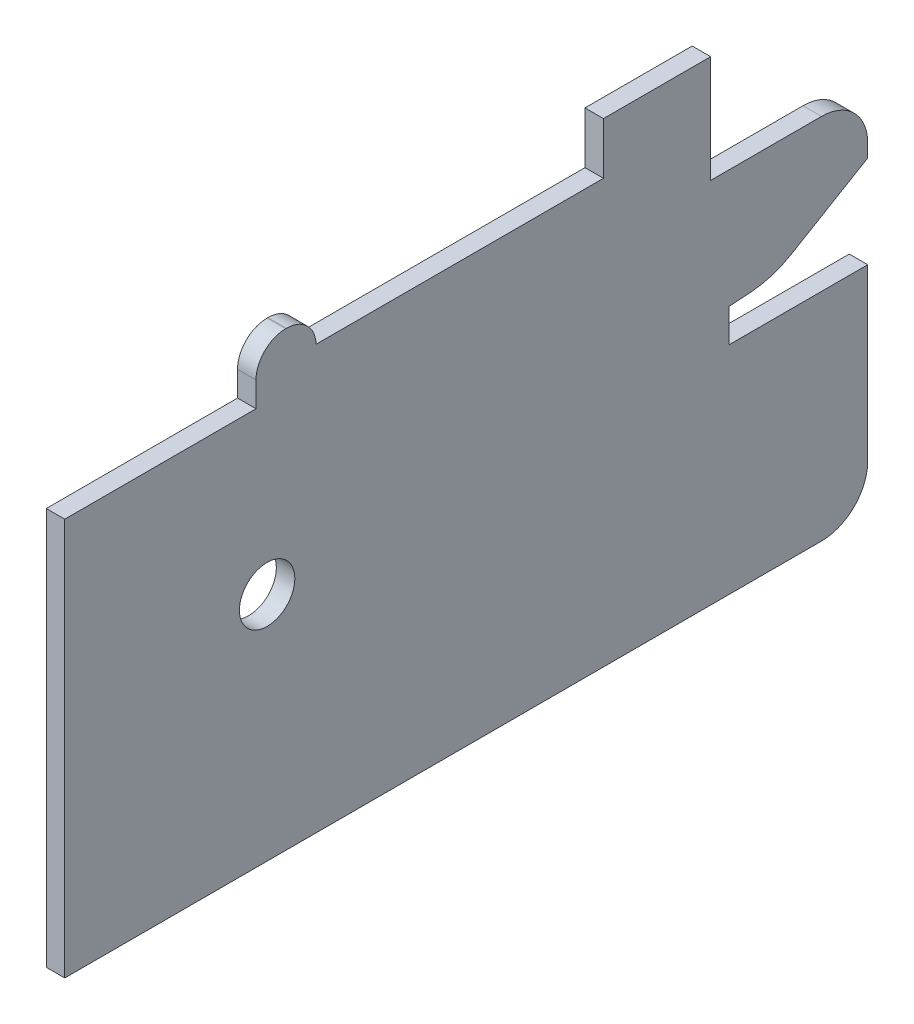
ISO-10303-21;
HEADER;
FILE_DESCRIPTION(('STEP AP214'),'2;1');
FILE_NAME('part.step','',(''),(''),'','','');
FILE_SCHEMA(('AUTOMOTIVE_DESIGN { 1 0 10303 214 1 1 1 1 }'));
ENDSEC;
DATA;
#1=APPLICATION_CONTEXT('core data for automotive mechanical design processes');
#2=APPLICATION_PROTOCOL_DEFINITION('international standard','automotive_design',2000,#1);
#3=PRODUCT_CONTEXT('',#1,'mechanical');
#4=PRODUCT('Part','Part','',(#3));
#5=PRODUCT_RELATED_PRODUCT_CATEGORY('part','',(#4));
#6=PRODUCT_DEFINITION_FORMATION('','',#4);
#7=PRODUCT_DEFINITION_CONTEXT('part definition',#1,'design');
#8=PRODUCT_DEFINITION('design','',#6,#7);
#9=PRODUCT_DEFINITION_SHAPE('','',#8);
#10=(LENGTH_UNIT() NAMED_UNIT(*) SI_UNIT(.MILLI.,.METRE.));
#11=(NAMED_UNIT(*) PLANE_ANGLE_UNIT() SI_UNIT($,.RADIAN.));
#12=(NAMED_UNIT(*) SI_UNIT($,.STERADIAN.) SOLID_ANGLE_UNIT());
#13=UNCERTAINTY_MEASURE_WITH_UNIT(LENGTH_MEASURE(1.E-05),#10,'distance_accuracy_value','');
#14=(GEOMETRIC_REPRESENTATION_CONTEXT(3) GLOBAL_UNCERTAINTY_ASSIGNED_CONTEXT((#13)) GLOBAL_UNIT_ASSIGNED_CONTEXT((#10,
#11,#12)) REPRESENTATION_CONTEXT('',''));
#15=CARTESIAN_POINT('',(0.,0.,0.));
#16=DIRECTION('',(0.,0.,1.));
#17=DIRECTION('',(1.,0.,0.));
#18=AXIS2_PLACEMENT_3D('',#15,#16,#17);
#19=CARTESIAN_POINT('',(-2.,23.4,0.));
#20=DIRECTION('',(0.,0.,-1.));
#21=DIRECTION('',(0.,1.,0.));
#22=AXIS2_PLACEMENT_3D('',#19,#20,#21);
#23=PLANE('',#22);
#24=DIRECTION('',(0.,1.,0.));
#25=VECTOR('',#24,1.);
#26=CARTESIAN_POINT('',(0.,23.4,0.));
#27=LINE('',#26,#25);
#28=CARTESIAN_POINT('',(0.,5.,0.));
#29=VERTEX_POINT('',#28);
#30=CARTESIAN_POINT('',(0.,23.4,0.));
#31=VERTEX_POINT('',#30);
#32=EDGE_CURVE('E240',#29,#31,#27,.T.);
#33=ORIENTED_EDGE('',*,*,#32,.F.);
#34=DIRECTION('',(1.,0.,0.));
#35=VECTOR('',#34,1.);
#36=CARTESIAN_POINT('',(-2.,5.,0.));
#37=LINE('',#36,#35);
#38=CARTESIAN_POINT('',(-2.,5.,0.));
#39=VERTEX_POINT('',#38);
#40=EDGE_CURVE('E181',#29,#39,#37,.F.);
#41=ORIENTED_EDGE('',*,*,#40,.T.);
#42=DIRECTION('',(0.,1.,0.));
#43=VECTOR('',#42,1.);
#44=CARTESIAN_POINT('',(-2.,23.4,0.));
#45=LINE('',#44,#43);
#46=CARTESIAN_POINT('',(-2.,23.4,0.));
#47=VERTEX_POINT('',#46);
#48=EDGE_CURVE('E175',#39,#47,#45,.T.);
#49=ORIENTED_EDGE('',*,*,#48,.T.);
#50=DIRECTION('',(1.,0.,0.));
#51=VECTOR('',#50,1.);
#52=CARTESIAN_POINT('',(-2.,23.4,0.));
#53=LINE('',#52,#51);
#54=EDGE_CURVE('E178',#47,#31,#53,.T.);
#55=ORIENTED_EDGE('',*,*,#54,.T.);
#56=EDGE_LOOP('',(#33,#41,#49,#55));
#57=FACE_BOUND('',#56,.T.);
#58=ADVANCED_FACE('F33',(#57),#23,.T.);
#59=CARTESIAN_POINT('',(-2.,0.,0.));
#60=DIRECTION('',(0.,-1.,0.));
#61=DIRECTION('',(0.,0.,-1.));
#62=AXIS2_PLACEMENT_3D('',#59,#60,#61);
#63=PLANE('',#62);
#64=DIRECTION('',(0.,0.,-1.));
#65=VECTOR('',#64,1.);
#66=CARTESIAN_POINT('',(-2.,0.,0.));
#67=LINE('',#66,#65);
#68=CARTESIAN_POINT('',(-2.,0.,86.9));
#69=VERTEX_POINT('',#68);
#70=CARTESIAN_POINT('',(-2.,0.,5.));
#71=VERTEX_POINT('',#70);
#72=EDGE_CURVE('E194',#69,#71,#67,.T.);
#73=ORIENTED_EDGE('',*,*,#72,.T.);
#74=DIRECTION('',(1.,0.,0.));
#75=VECTOR('',#74,1.);
#76=CARTESIAN_POINT('',(-2.,0.,5.));
#77=LINE('',#76,#75);
#78=CARTESIAN_POINT('',(0.,0.,5.));
#79=VERTEX_POINT('',#78);
#80=EDGE_CURVE('E283',#71,#79,#77,.T.);
#81=ORIENTED_EDGE('',*,*,#80,.T.);
#82=DIRECTION('',(0.,0.,-1.));
#83=VECTOR('',#82,1.);
#84=CARTESIAN_POINT('',(0.,0.,0.));
#85=LINE('',#84,#83);
#86=CARTESIAN_POINT('',(0.,0.,86.9));
#87=VERTEX_POINT('',#86);
#88=EDGE_CURVE('E186',#87,#79,#85,.T.);
#89=ORIENTED_EDGE('',*,*,#88,.F.);
#90=DIRECTION('',(1.,0.,0.));
#91=VECTOR('',#90,1.);
#92=CARTESIAN_POINT('',(-2.,0.,86.9));
#93=LINE('',#92,#91);
#94=EDGE_CURVE('E281',#69,#87,#93,.T.);
#95=ORIENTED_EDGE('',*,*,#94,.F.);
#96=EDGE_LOOP('',(#73,#81,#89,#95));
#97=FACE_BOUND('',#96,.T.);
#98=ADVANCED_FACE('F369',(#97),#63,.T.);
#99=CARTESIAN_POINT('',(-2.,0.,86.9));
#100=DIRECTION('',(0.,0.,1.));
#101=DIRECTION('',(1.,0.,0.));
#102=AXIS2_PLACEMENT_3D('',#99,#100,#101);
#103=PLANE('',#102);
#104=DIRECTION('',(0.,-1.,0.));
#105=VECTOR('',#104,1.);
#106=CARTESIAN_POINT('',(0.,0.,86.9));
#107=LINE('',#106,#105);
#108=CARTESIAN_POINT('',(0.,43.,86.9));
#109=VERTEX_POINT('',#108);
#110=EDGE_CURVE('E276',#109,#87,#107,.T.);
#111=ORIENTED_EDGE('',*,*,#110,.F.);
#112=DIRECTION('',(1.,0.,0.));
#113=VECTOR('',#112,1.);
#114=CARTESIAN_POINT('',(-2.,43.,86.9));
#115=LINE('',#114,#113);
#116=CARTESIAN_POINT('',(-2.,43.,86.9));
#117=VERTEX_POINT('',#116);
#118=EDGE_CURVE('E284',#117,#109,#115,.T.);
#119=ORIENTED_EDGE('',*,*,#118,.F.);
#120=DIRECTION('',(0.,-1.,0.));
#121=VECTOR('',#120,1.);
#122=CARTESIAN_POINT('',(-2.,0.,86.9));
#123=LINE('',#122,#121);
#124=EDGE_CURVE('E235',#117,#69,#123,.T.);
#125=ORIENTED_EDGE('',*,*,#124,.T.);
#126=ORIENTED_EDGE('',*,*,#94,.T.);
#127=EDGE_LOOP('',(#111,#119,#125,#126));
#128=FACE_BOUND('',#127,.T.);
#129=ADVANCED_FACE('F428',(#128),#103,.T.);
#130=CARTESIAN_POINT('',(-2.,43.,86.9));
#131=DIRECTION('',(0.,1.,0.));
#132=DIRECTION('',(0.,0.,1.));
#133=AXIS2_PLACEMENT_3D('',#130,#131,#132);
#134=PLANE('',#133);
#135=DIRECTION('',(0.,0.,1.));
#136=VECTOR('',#135,1.);
#137=CARTESIAN_POINT('',(0.,43.,86.9));
#138=LINE('',#137,#136);
#139=CARTESIAN_POINT('',(0.,43.,66.2));
#140=VERTEX_POINT('',#139);
#141=EDGE_CURVE('E273',#140,#109,#138,.T.);
#142=ORIENTED_EDGE('',*,*,#141,.F.);
#143=DIRECTION('',(1.,0.,0.));
#144=VECTOR('',#143,1.);
#145=CARTESIAN_POINT('',(-2.,43.,66.2));
#146=LINE('',#145,#144);
#147=CARTESIAN_POINT('',(-2.,43.,66.2));
#148=VERTEX_POINT('',#147);
#149=EDGE_CURVE('E286',#148,#140,#146,.T.);
#150=ORIENTED_EDGE('',*,*,#149,.F.);
#151=DIRECTION('',(0.,0.,1.));
#152=VECTOR('',#151,1.);
#153=CARTESIAN_POINT('',(-2.,43.,86.9));
#154=LINE('',#153,#152);
#155=EDGE_CURVE('E232',#148,#117,#154,.T.);
#156=ORIENTED_EDGE('',*,*,#155,.T.);
#157=ORIENTED_EDGE('',*,*,#118,.T.);
#158=EDGE_LOOP('',(#142,#150,#156,#157));
#159=FACE_BOUND('',#158,.T.);
#160=ADVANCED_FACE('F364',(#159),#134,.T.);
#161=CARTESIAN_POINT('',(-2.,43.,66.2));
#162=DIRECTION('',(0.,0.,1.));
#163=DIRECTION('',(1.,0.,0.));
#164=AXIS2_PLACEMENT_3D('',#161,#162,#163);
#165=PLANE('',#164);
#166=DIRECTION('',(0.,-1.,0.));
#167=VECTOR('',#166,1.);
#168=CARTESIAN_POINT('',(0.,43.,66.2));
#169=LINE('',#168,#167);
#170=CARTESIAN_POINT('',(0.,45.6960877582272,66.2));
#171=VERTEX_POINT('',#170);
#172=EDGE_CURVE('E271',#171,#140,#169,.T.);
#173=ORIENTED_EDGE('',*,*,#172,.F.);
#174=DIRECTION('',(1.,0.,0.));
#175=VECTOR('',#174,1.);
#176=CARTESIAN_POINT('',(-2.,45.6960877582272,66.2));
#177=LINE('',#176,#175);
#178=CARTESIAN_POINT('',(-2.,45.6960877582272,66.2));
#179=VERTEX_POINT('',#178);
#180=EDGE_CURVE('E48',#171,#179,#177,.F.);
#181=ORIENTED_EDGE('',*,*,#180,.T.);
#182=DIRECTION('',(0.,-1.,0.));
#183=VECTOR('',#182,1.);
#184=CARTESIAN_POINT('',(-2.,43.,66.2));
#185=LINE('',#184,#183);
#186=EDGE_CURVE('E230',#179,#148,#185,.T.);
#187=ORIENTED_EDGE('',*,*,#186,.T.);
#188=ORIENTED_EDGE('',*,*,#149,.T.);
#189=EDGE_LOOP('',(#173,#181,#187,#188));
#190=FACE_BOUND('',#189,.T.);
#191=ADVANCED_FACE('F361',(#190),#165,.T.);
#192=CARTESIAN_POINT('',(-2.,48.8960877582272,66.2));
#193=DIRECTION('',(0.,1.,0.));
#194=DIRECTION('',(0.,0.,1.));
#195=AXIS2_PLACEMENT_3D('',#192,#193,#194);
#196=PLANE('',#195);
#197=DIRECTION('',(0.,0.,1.));
#198=VECTOR('',#197,1.);
#199=CARTESIAN_POINT('',(-2.,48.8960877582272,66.2));
#200=LINE('',#199,#198);
#201=CARTESIAN_POINT('',(-2.,48.8960877582272,62.8984371183439));
#202=VERTEX_POINT('',#201);
#203=CARTESIAN_POINT('',(-2.,48.8960877582272,63.));
#204=VERTEX_POINT('',#203);
#205=EDGE_CURVE('E227',#202,#204,#200,.T.);
#206=ORIENTED_EDGE('',*,*,#205,.T.);
#207=DIRECTION('',(1.,0.,0.));
#208=VECTOR('',#207,1.);
#209=CARTESIAN_POINT('',(-2.,48.8960877582272,63.));
#210=LINE('',#209,#208);
#211=CARTESIAN_POINT('',(0.,48.8960877582272,63.));
#212=VERTEX_POINT('',#211);
#213=EDGE_CURVE('E334',#204,#212,#210,.T.);
#214=ORIENTED_EDGE('',*,*,#213,.T.);
#215=DIRECTION('',(0.,0.,1.));
#216=VECTOR('',#215,1.);
#217=CARTESIAN_POINT('',(0.,48.8960877582272,66.2));
#218=LINE('',#217,#216);
#219=CARTESIAN_POINT('',(0.,48.8960877582272,62.8984371183439));
#220=VERTEX_POINT('',#219);
#221=EDGE_CURVE('E269',#220,#212,#218,.T.);
#222=ORIENTED_EDGE('',*,*,#221,.F.);
#223=DIRECTION('',(-1.,0.,0.));
#224=VECTOR('',#223,1.);
#225=CARTESIAN_POINT('',(-2.,48.8960877582272,62.8984371183439));
#226=LINE('',#225,#224);
#227=EDGE_CURVE('E332',#220,#202,#226,.T.);
#228=ORIENTED_EDGE('',*,*,#227,.T.);
#229=EDGE_LOOP('',(#206,#214,#222,#228));
#230=FACE_BOUND('',#229,.T.);
#231=ADVANCED_FACE('F353',(#230),#196,.T.);
#232=CARTESIAN_POINT('',(-2.,45.7960877582272,59.7));
#233=DIRECTION('',(0.,1.,0.));
#234=DIRECTION('',(0.,0.,1.));
#235=AXIS2_PLACEMENT_3D('',#232,#233,#234);
#236=PLANE('',#235);
#237=DIRECTION('',(0.,0.,1.));
#238=VECTOR('',#237,1.);
#239=CARTESIAN_POINT('',(0.,45.7960877582272,59.7));
#240=LINE('',#239,#238);
#241=CARTESIAN_POINT('',(0.,45.7960877582272,28.6));
#242=VERTEX_POINT('',#241);
#243=CARTESIAN_POINT('',(0.,45.7960877582272,59.7));
#244=VERTEX_POINT('',#243);
#245=EDGE_CURVE('E266',#242,#244,#240,.T.);
#246=ORIENTED_EDGE('',*,*,#245,.F.);
#247=DIRECTION('',(1.,0.,0.));
#248=VECTOR('',#247,1.);
#249=CARTESIAN_POINT('',(-2.,45.7960877582272,28.6));
#250=LINE('',#249,#248);
#251=CARTESIAN_POINT('',(-2.,45.7960877582272,28.6));
#252=VERTEX_POINT('',#251);
#253=EDGE_CURVE('E292',#252,#242,#250,.T.);
#254=ORIENTED_EDGE('',*,*,#253,.F.);
#255=DIRECTION('',(0.,0.,1.));
#256=VECTOR('',#255,1.);
#257=CARTESIAN_POINT('',(-2.,45.7960877582272,59.7));
#258=LINE('',#257,#256);
#259=CARTESIAN_POINT('',(-2.,45.7960877582272,59.7));
#260=VERTEX_POINT('',#259);
#261=EDGE_CURVE('E224',#252,#260,#258,.T.);
#262=ORIENTED_EDGE('',*,*,#261,.T.);
#263=DIRECTION('',(1.,0.,0.));
#264=VECTOR('',#263,1.);
#265=CARTESIAN_POINT('',(-2.,45.7960877582272,59.7));
#266=LINE('',#265,#264);
#267=EDGE_CURVE('E289',#260,#244,#266,.T.);
#268=ORIENTED_EDGE('',*,*,#267,.T.);
#269=EDGE_LOOP('',(#246,#254,#262,#268));
#270=FACE_BOUND('',#269,.T.);
#271=ADVANCED_FACE('F349',(#270),#236,.T.);
#272=CARTESIAN_POINT('',(-2.,45.7960877582272,28.6));
#273=DIRECTION('',(0.,0.,1.));
#274=DIRECTION('',(1.,0.,0.));
#275=AXIS2_PLACEMENT_3D('',#272,#273,#274);
#276=PLANE('',#275);
#277=DIRECTION('',(0.,-1.,0.));
#278=VECTOR('',#277,1.);
#279=CARTESIAN_POINT('',(0.,45.7960877582272,28.6));
#280=LINE('',#279,#278);
#281=CARTESIAN_POINT('',(0.,51.3960877582272,28.6));
#282=VERTEX_POINT('',#281);
#283=EDGE_CURVE('E263',#282,#242,#280,.T.);
#284=ORIENTED_EDGE('',*,*,#283,.F.);
#285=DIRECTION('',(1.,0.,0.));
#286=VECTOR('',#285,1.);
#287=CARTESIAN_POINT('',(-2.,51.3960877582272,28.6));
#288=LINE('',#287,#286);
#289=CARTESIAN_POINT('',(-2.,51.3960877582272,28.6));
#290=VERTEX_POINT('',#289);
#291=EDGE_CURVE('E294',#290,#282,#288,.T.);
#292=ORIENTED_EDGE('',*,*,#291,.F.);
#293=DIRECTION('',(0.,-1.,0.));
#294=VECTOR('',#293,1.);
#295=CARTESIAN_POINT('',(-2.,45.7960877582272,28.6));
#296=LINE('',#295,#294);
#297=EDGE_CURVE('E221',#290,#252,#296,.T.);
#298=ORIENTED_EDGE('',*,*,#297,.T.);
#299=ORIENTED_EDGE('',*,*,#253,.T.);
#300=EDGE_LOOP('',(#284,#292,#298,#299));
#301=FACE_BOUND('',#300,.T.);
#302=ADVANCED_FACE('F414',(#301),#276,.T.);
#303=CARTESIAN_POINT('',(-2.,51.3960877582272,28.6));
#304=DIRECTION('',(0.,1.,0.));
#305=DIRECTION('',(0.,0.,1.));
#306=AXIS2_PLACEMENT_3D('',#303,#304,#305);
#307=PLANE('',#306);
#308=DIRECTION('',(0.,0.,1.));
#309=VECTOR('',#308,1.);
#310=CARTESIAN_POINT('',(0.,51.3960877582272,28.6));
#311=LINE('',#310,#309);
#312=CARTESIAN_POINT('',(0.,51.3960877582272,17.));
#313=VERTEX_POINT('',#312);
#314=EDGE_CURVE('E260',#313,#282,#311,.T.);
#315=ORIENTED_EDGE('',*,*,#314,.F.);
#316=DIRECTION('',(1.,0.,0.));
#317=VECTOR('',#316,1.);
#318=CARTESIAN_POINT('',(-2.,51.3960877582272,17.));
#319=LINE('',#318,#317);
#320=CARTESIAN_POINT('',(-2.,51.3960877582272,17.));
#321=VERTEX_POINT('',#320);
#322=EDGE_CURVE('E296',#321,#313,#319,.T.);
#323=ORIENTED_EDGE('',*,*,#322,.F.);
#324=DIRECTION('',(0.,0.,1.));
#325=VECTOR('',#324,1.);
#326=CARTESIAN_POINT('',(-2.,51.3960877582272,28.6));
#327=LINE('',#326,#325);
#328=EDGE_CURVE('E218',#321,#290,#327,.T.);
#329=ORIENTED_EDGE('',*,*,#328,.T.);
#330=ORIENTED_EDGE('',*,*,#291,.T.);
#331=EDGE_LOOP('',(#315,#323,#329,#330));
#332=FACE_BOUND('',#331,.T.);
#333=ADVANCED_FACE('F412',(#332),#307,.T.);
#334=CARTESIAN_POINT('',(-2.,51.3960877582272,17.));
#335=DIRECTION('',(0.,0.,-1.));
#336=DIRECTION('',(-1.,0.,0.));
#337=AXIS2_PLACEMENT_3D('',#334,#335,#336);
#338=PLANE('',#337);
#339=DIRECTION('',(0.,1.,0.));
#340=VECTOR('',#339,1.);
#341=CARTESIAN_POINT('',(0.,51.3960877582272,17.));
#342=LINE('',#341,#340);
#343=CARTESIAN_POINT('',(0.,39.8,17.));
#344=VERTEX_POINT('',#343);
#345=EDGE_CURVE('E257',#344,#313,#342,.T.);
#346=ORIENTED_EDGE('',*,*,#345,.F.);
#347=DIRECTION('',(1.,0.,0.));
#348=VECTOR('',#347,1.);
#349=CARTESIAN_POINT('',(-2.,39.8,17.));
#350=LINE('',#349,#348);
#351=CARTESIAN_POINT('',(-2.,39.8,17.));
#352=VERTEX_POINT('',#351);
#353=EDGE_CURVE('E298',#352,#344,#350,.T.);
#354=ORIENTED_EDGE('',*,*,#353,.F.);
#355=DIRECTION('',(0.,1.,0.));
#356=VECTOR('',#355,1.);
#357=CARTESIAN_POINT('',(-2.,51.3960877582272,17.));
#358=LINE('',#357,#356);
#359=EDGE_CURVE('E215',#352,#321,#358,.T.);
#360=ORIENTED_EDGE('',*,*,#359,.T.);
#361=ORIENTED_EDGE('',*,*,#322,.T.);
#362=EDGE_LOOP('',(#346,#354,#360,#361));
#363=FACE_BOUND('',#362,.T.);
#364=ADVANCED_FACE('F408',(#363),#338,.T.);
#365=CARTESIAN_POINT('',(-2.,39.8,17.));
#366=DIRECTION('',(0.,1.,0.));
#367=DIRECTION('',(0.,0.,1.));
#368=AXIS2_PLACEMENT_3D('',#365,#366,#367);
#369=PLANE('',#368);
#370=DIRECTION('',(0.,0.,1.));
#371=VECTOR('',#370,1.);
#372=CARTESIAN_POINT('',(0.,39.8,17.));
#373=LINE('',#372,#371);
#374=CARTESIAN_POINT('',(0.,39.8,5.));
#375=VERTEX_POINT('',#374);
#376=EDGE_CURVE('E255',#375,#344,#373,.T.);
#377=ORIENTED_EDGE('',*,*,#376,.F.);
#378=DIRECTION('',(1.,0.,0.));
#379=VECTOR('',#378,1.);
#380=CARTESIAN_POINT('',(-2.,39.8,5.));
#381=LINE('',#380,#379);
#382=CARTESIAN_POINT('',(-2.,39.8,5.));
#383=VERTEX_POINT('',#382);
#384=EDGE_CURVE('E321',#375,#383,#381,.F.);
#385=ORIENTED_EDGE('',*,*,#384,.T.);
#386=DIRECTION('',(0.,0.,1.));
#387=VECTOR('',#386,1.);
#388=CARTESIAN_POINT('',(-2.,39.8,17.));
#389=LINE('',#388,#387);
#390=EDGE_CURVE('E213',#383,#352,#389,.T.);
#391=ORIENTED_EDGE('',*,*,#390,.T.);
#392=ORIENTED_EDGE('',*,*,#353,.T.);
#393=EDGE_LOOP('',(#377,#385,#391,#392));
#394=FACE_BOUND('',#393,.T.);
#395=ADVANCED_FACE('F399',(#394),#369,.T.);
#396=CARTESIAN_POINT('',(-2.,39.8,0.));
#397=DIRECTION('',(0.,0.,-1.));
#398=DIRECTION('',(0.,1.,0.));
#399=AXIS2_PLACEMENT_3D('',#396,#397,#398);
#400=PLANE('',#399);
#401=DIRECTION('',(0.,1.,0.));
#402=VECTOR('',#401,1.);
#403=CARTESIAN_POINT('',(-2.,39.8,0.));
#404=LINE('',#403,#402);
#405=CARTESIAN_POINT('',(-2.,33.4,0.));
#406=VERTEX_POINT('',#405);
#407=CARTESIAN_POINT('',(-2.,34.8,0.));
#408=VERTEX_POINT('',#407);
#409=EDGE_CURVE('E210',#406,#408,#404,.T.);
#410=ORIENTED_EDGE('',*,*,#409,.T.);
#411=DIRECTION('',(1.,0.,0.));
#412=VECTOR('',#411,1.);
#413=CARTESIAN_POINT('',(-2.,34.8,0.));
#414=LINE('',#413,#412);
#415=CARTESIAN_POINT('',(0.,34.8,0.));
#416=VERTEX_POINT('',#415);
#417=EDGE_CURVE('E318',#408,#416,#414,.T.);
#418=ORIENTED_EDGE('',*,*,#417,.T.);
#419=DIRECTION('',(0.,1.,0.));
#420=VECTOR('',#419,1.);
#421=CARTESIAN_POINT('',(0.,39.8,0.));
#422=LINE('',#421,#420);
#423=CARTESIAN_POINT('',(0.,33.4,0.));
#424=VERTEX_POINT('',#423);
#425=EDGE_CURVE('E252',#424,#416,#422,.T.);
#426=ORIENTED_EDGE('',*,*,#425,.F.);
#427=DIRECTION('',(1.,0.,0.));
#428=VECTOR('',#427,1.);
#429=CARTESIAN_POINT('',(-2.,33.4,0.));
#430=LINE('',#429,#428);
#431=EDGE_CURVE('E301',#406,#424,#430,.T.);
#432=ORIENTED_EDGE('',*,*,#431,.F.);
#433=EDGE_LOOP('',(#410,#418,#426,#432));
#434=FACE_BOUND('',#433,.T.);
#435=ADVANCED_FACE('F393',(#434),#400,.T.);
#436=CARTESIAN_POINT('',(-2.,33.4,0.));
#437=DIRECTION('',(0.,-0.861160392855026,-0.508333333333333));
#438=DIRECTION('',(0.,0.508333333333333,-0.861160392855026));
#439=AXIS2_PLACEMENT_3D('',#436,#437,#438);
#440=PLANE('',#439);
#441=DIRECTION('',(0.,0.508333333333333,-0.861160392855026));
#442=VECTOR('',#441,1.);
#443=CARTESIAN_POINT('',(0.,33.4,0.));
#444=LINE('',#443,#442);
#445=CARTESIAN_POINT('',(0.,28.5144984934904,8.27645979666813));
#446=VERTEX_POINT('',#445);
#447=EDGE_CURVE('E250',#446,#424,#444,.T.);
#448=ORIENTED_EDGE('',*,*,#447,.F.);
#449=DIRECTION('',(1.,0.,0.));
#450=VECTOR('',#449,1.);
#451=CARTESIAN_POINT('',(-2.,28.5144984934904,8.27645979666813));
#452=LINE('',#451,#450);
#453=CARTESIAN_POINT('',(-2.,28.5144984934904,8.27645979666813));
#454=VERTEX_POINT('',#453);
#455=EDGE_CURVE('E328',#446,#454,#452,.F.);
#456=ORIENTED_EDGE('',*,*,#455,.T.);
#457=DIRECTION('',(0.,0.508333333333333,-0.861160392855026));
#458=VECTOR('',#457,1.);
#459=CARTESIAN_POINT('',(-2.,33.4,0.));
#460=LINE('',#459,#458);
#461=EDGE_CURVE('E208',#454,#406,#460,.T.);
#462=ORIENTED_EDGE('',*,*,#461,.T.);
#463=ORIENTED_EDGE('',*,*,#431,.T.);
#464=EDGE_LOOP('',(#448,#456,#462,#463));
#465=FACE_BOUND('',#464,.T.);
#466=ADVANCED_FACE('F387',(#465),#440,.T.);
#467=CARTESIAN_POINT('',(-2.,27.3,10.3339247142603));
#468=DIRECTION('',(0.,-0.997939535473227,-0.0641613866704918));
#469=DIRECTION('',(0.,0.0641613866704918,-0.997939535473227));
#470=AXIS2_PLACEMENT_3D('',#467,#468,#469);
#471=PLANE('',#470);
#472=DIRECTION('',(0.,0.0641613866704918,-0.997939535473227));
#473=VECTOR('',#472,1.);
#474=CARTESIAN_POINT('',(-2.,27.3,10.3339247142603));
#475=LINE('',#474,#473);
#476=CARTESIAN_POINT('',(-2.,27.,15.));
#477=VERTEX_POINT('',#476);
#478=CARTESIAN_POINT('',(-2.,27.1467070673084,12.7181792632965));
#479=VERTEX_POINT('',#478);
#480=EDGE_CURVE('E202',#477,#479,#475,.T.);
#481=ORIENTED_EDGE('',*,*,#480,.T.);
#482=DIRECTION('',(1.,0.,0.));
#483=VECTOR('',#482,1.);
#484=CARTESIAN_POINT('',(-2.,27.1467070673084,12.7181792632965));
#485=LINE('',#484,#483);
#486=CARTESIAN_POINT('',(0.,27.1467070673084,12.7181792632965));
#487=VERTEX_POINT('',#486);
#488=EDGE_CURVE('E323',#479,#487,#485,.T.);
#489=ORIENTED_EDGE('',*,*,#488,.T.);
#490=DIRECTION('',(0.,0.0641613866704918,-0.997939535473227));
#491=VECTOR('',#490,1.);
#492=CARTESIAN_POINT('',(0.,27.3,10.3339247142603));
#493=LINE('',#492,#491);
#494=CARTESIAN_POINT('',(0.,27.,15.));
#495=VERTEX_POINT('',#494);
#496=EDGE_CURVE('E247',#495,#487,#493,.T.);
#497=ORIENTED_EDGE('',*,*,#496,.F.);
#498=DIRECTION('',(1.,0.,0.));
#499=VECTOR('',#498,1.);
#500=CARTESIAN_POINT('',(-2.,27.,15.));
#501=LINE('',#500,#499);
#502=EDGE_CURVE('E304',#477,#495,#501,.T.);
#503=ORIENTED_EDGE('',*,*,#502,.F.);
#504=EDGE_LOOP('',(#481,#489,#497,#503));
#505=FACE_BOUND('',#504,.T.);
#506=ADVANCED_FACE('F379',(#505),#471,.T.);
#507=CARTESIAN_POINT('',(-2.,27.,15.));
#508=DIRECTION('',(0.,0.,-1.));
#509=DIRECTION('',(0.,1.,0.));
#510=AXIS2_PLACEMENT_3D('',#507,#508,#509);
#511=PLANE('',#510);
#512=DIRECTION('',(0.,1.,0.));
#513=VECTOR('',#512,1.);
#514=CARTESIAN_POINT('',(0.,27.,15.));
#515=LINE('',#514,#513);
#516=CARTESIAN_POINT('',(0.,23.4,15.));
#517=VERTEX_POINT('',#516);
#518=EDGE_CURVE('E244',#517,#495,#515,.T.);
#519=ORIENTED_EDGE('',*,*,#518,.F.);
#520=DIRECTION('',(1.,0.,0.));
#521=VECTOR('',#520,1.);
#522=CARTESIAN_POINT('',(-2.,23.4,15.));
#523=LINE('',#522,#521);
#524=CARTESIAN_POINT('',(-2.,23.4,15.));
#525=VERTEX_POINT('',#524);
#526=EDGE_CURVE('E193',#525,#517,#523,.T.);
#527=ORIENTED_EDGE('',*,*,#526,.F.);
#528=DIRECTION('',(0.,1.,0.));
#529=VECTOR('',#528,1.);
#530=CARTESIAN_POINT('',(-2.,27.,15.));
#531=LINE('',#530,#529);
#532=EDGE_CURVE('E200',#525,#477,#531,.T.);
#533=ORIENTED_EDGE('',*,*,#532,.T.);
#534=ORIENTED_EDGE('',*,*,#502,.T.);
#535=EDGE_LOOP('',(#519,#527,#533,#534));
#536=FACE_BOUND('',#535,.T.);
#537=ADVANCED_FACE('F377',(#536),#511,.T.);
#538=CARTESIAN_POINT('',(-2.,23.4,15.));
#539=DIRECTION('',(0.,1.,0.));
#540=DIRECTION('',(0.,0.,1.));
#541=AXIS2_PLACEMENT_3D('',#538,#539,#540);
#542=PLANE('',#541);
#543=DIRECTION('',(0.,0.,1.));
#544=VECTOR('',#543,1.);
#545=CARTESIAN_POINT('',(0.,23.4,15.));
#546=LINE('',#545,#544);
#547=EDGE_CURVE('E192',#31,#517,#546,.T.);
#548=ORIENTED_EDGE('',*,*,#547,.F.);
#549=ORIENTED_EDGE('',*,*,#54,.F.);
#550=DIRECTION('',(0.,0.,1.));
#551=VECTOR('',#550,1.);
#552=CARTESIAN_POINT('',(-2.,23.4,15.));
#553=LINE('',#552,#551);
#554=EDGE_CURVE('E185',#47,#525,#553,.T.);
#555=ORIENTED_EDGE('',*,*,#554,.T.);
#556=ORIENTED_EDGE('',*,*,#526,.T.);
#557=EDGE_LOOP('',(#548,#549,#555,#556));
#558=FACE_BOUND('',#557,.T.);
#559=ADVANCED_FACE('F190',(#558),#542,.T.);
#560=CARTESIAN_POINT('',(-2.,0.,0.));
#561=DIRECTION('',(-1.,0.,0.));
#562=DIRECTION('',(0.,0.,1.));
#563=AXIS2_PLACEMENT_3D('',#560,#561,#562);
#564=PLANE('',#563);
#565=CARTESIAN_POINT('',(-2.,25.,65.));
#566=DIRECTION('',(-1.,0.,0.));
#567=DIRECTION('',(0.,0.,1.));
#568=AXIS2_PLACEMENT_3D('',#565,#566,#567);
#569=CIRCLE('',#568,3.00000000000001);
#570=CARTESIAN_POINT('',(-2.,25.,68.));
#571=VERTEX_POINT('',#570);
#572=EDGE_CURVE('E242',#571,#571,#569,.F.);
#573=ORIENTED_EDGE('',*,*,#572,.T.);
#574=EDGE_LOOP('',(#573));
#575=FACE_BOUND('',#574,.T.);
#576=ORIENTED_EDGE('',*,*,#186,.F.);
#577=CARTESIAN_POINT('',(-2.,45.6960877582272,63.));
#578=DIRECTION('',(-1.,0.,0.));
#579=DIRECTION('',(0.,0.,1.));
#580=AXIS2_PLACEMENT_3D('',#577,#578,#579);
#581=CIRCLE('',#580,3.2);
#582=EDGE_CURVE('E11',#179,#204,#581,.T.);
#583=ORIENTED_EDGE('',*,*,#582,.T.);
#584=ORIENTED_EDGE('',*,*,#205,.F.);
#585=CARTESIAN_POINT('',(-2.,45.6960877582272,62.8984371183439));
#586=DIRECTION('',(-1.,0.,0.));
#587=DIRECTION('',(0.,0.,1.));
#588=AXIS2_PLACEMENT_3D('',#585,#586,#587);
#589=CIRCLE('',#588,3.2);
#590=EDGE_CURVE('E41',#202,#260,#589,.T.);
#591=ORIENTED_EDGE('',*,*,#590,.T.);
#592=ORIENTED_EDGE('',*,*,#261,.F.);
#593=ORIENTED_EDGE('',*,*,#297,.F.);
#594=ORIENTED_EDGE('',*,*,#328,.F.);
#595=ORIENTED_EDGE('',*,*,#359,.F.);
#596=ORIENTED_EDGE('',*,*,#390,.F.);
#597=CARTESIAN_POINT('',(-2.,34.8,5.));
#598=DIRECTION('',(-1.,0.,0.));
#599=DIRECTION('',(0.,0.,1.));
#600=AXIS2_PLACEMENT_3D('',#597,#598,#599);
#601=CIRCLE('',#600,5.);
#602=EDGE_CURVE('E314',#383,#408,#601,.T.);
#603=ORIENTED_EDGE('',*,*,#602,.T.);
#604=ORIENTED_EDGE('',*,*,#409,.F.);
#605=ORIENTED_EDGE('',*,*,#461,.F.);
#606=CARTESIAN_POINT('',(-2.,37.1261024220407,13.3597931300015));
#607=DIRECTION('',(-1.,0.,0.));
#608=DIRECTION('',(0.,0.,1.));
#609=AXIS2_PLACEMENT_3D('',#606,#607,#608);
#610=CIRCLE('',#609,10.);
#611=EDGE_CURVE('E330',#454,#479,#610,.T.);
#612=ORIENTED_EDGE('',*,*,#611,.T.);
#613=ORIENTED_EDGE('',*,*,#480,.F.);
#614=ORIENTED_EDGE('',*,*,#532,.F.);
#615=ORIENTED_EDGE('',*,*,#554,.F.);
#616=ORIENTED_EDGE('',*,*,#48,.F.);
#617=CARTESIAN_POINT('',(-2.,5.,5.));
#618=DIRECTION('',(-1.,0.,0.));
#619=DIRECTION('',(0.,0.,1.));
#620=AXIS2_PLACEMENT_3D('',#617,#618,#619);
#621=CIRCLE('',#620,5.);
#622=EDGE_CURVE('E316',#39,#71,#621,.T.);
#623=ORIENTED_EDGE('',*,*,#622,.T.);
#624=ORIENTED_EDGE('',*,*,#72,.F.);
#625=ORIENTED_EDGE('',*,*,#124,.F.);
#626=ORIENTED_EDGE('',*,*,#155,.F.);
#627=EDGE_LOOP('',(#576,#583,#584,#591,#592,#593,#594,#595,#596,#603,#604,#605,#612,#613,#614,
#615,#616,#623,#624,#625,#626));
#628=FACE_BOUND('',#627,.T.);
#629=ADVANCED_FACE('F197',(#575,#628),#564,.T.);
#630=CARTESIAN_POINT('',(0.,0.,0.));
#631=DIRECTION('',(-1.,0.,0.));
#632=DIRECTION('',(0.,0.,1.));
#633=AXIS2_PLACEMENT_3D('',#630,#631,#632);
#634=PLANE('',#633);
#635=CARTESIAN_POINT('',(0.,25.,65.));
#636=DIRECTION('',(1.,0.,0.));
#637=DIRECTION('',(0.,0.,-1.));
#638=AXIS2_PLACEMENT_3D('',#635,#636,#637);
#639=CIRCLE('',#638,3.00000000000001);
#640=CARTESIAN_POINT('',(0.,25.,62.));
#641=VERTEX_POINT('',#640);
#642=EDGE_CURVE('E613',#641,#641,#639,.T.);
#643=ORIENTED_EDGE('',*,*,#642,.F.);
#644=EDGE_LOOP('',(#643));
#645=FACE_BOUND('',#644,.T.);
#646=ORIENTED_EDGE('',*,*,#221,.T.);
#647=CARTESIAN_POINT('',(0.,45.6960877582272,63.));
#648=DIRECTION('',(-1.,0.,0.));
#649=DIRECTION('',(0.,0.,1.));
#650=AXIS2_PLACEMENT_3D('',#647,#648,#649);
#651=CIRCLE('',#650,3.2);
#652=EDGE_CURVE('E56',#212,#171,#651,.F.);
#653=ORIENTED_EDGE('',*,*,#652,.T.);
#654=ORIENTED_EDGE('',*,*,#172,.T.);
#655=ORIENTED_EDGE('',*,*,#141,.T.);
#656=ORIENTED_EDGE('',*,*,#110,.T.);
#657=ORIENTED_EDGE('',*,*,#88,.T.);
#658=CARTESIAN_POINT('',(0.,5.,5.));
#659=DIRECTION('',(-1.,0.,0.));
#660=DIRECTION('',(0.,0.,1.));
#661=AXIS2_PLACEMENT_3D('',#658,#659,#660);
#662=CIRCLE('',#661,5.);
#663=EDGE_CURVE('E311',#79,#29,#662,.F.);
#664=ORIENTED_EDGE('',*,*,#663,.T.);
#665=ORIENTED_EDGE('',*,*,#32,.T.);
#666=ORIENTED_EDGE('',*,*,#547,.T.);
#667=ORIENTED_EDGE('',*,*,#518,.T.);
#668=ORIENTED_EDGE('',*,*,#496,.T.);
#669=CARTESIAN_POINT('',(0.,37.1261024220407,13.3597931300015));
#670=DIRECTION('',(-1.,0.,0.));
#671=DIRECTION('',(0.,0.,1.));
#672=AXIS2_PLACEMENT_3D('',#669,#670,#671);
#673=CIRCLE('',#672,10.);
#674=EDGE_CURVE('E326',#487,#446,#673,.F.);
#675=ORIENTED_EDGE('',*,*,#674,.T.);
#676=ORIENTED_EDGE('',*,*,#447,.T.);
#677=ORIENTED_EDGE('',*,*,#425,.T.);
#678=CARTESIAN_POINT('',(0.,34.8,5.));
#679=DIRECTION('',(-1.,0.,0.));
#680=DIRECTION('',(0.,0.,1.));
#681=AXIS2_PLACEMENT_3D('',#678,#679,#680);
#682=CIRCLE('',#681,5.);
#683=EDGE_CURVE('E309',#416,#375,#682,.F.);
#684=ORIENTED_EDGE('',*,*,#683,.T.);
#685=ORIENTED_EDGE('',*,*,#376,.T.);
#686=ORIENTED_EDGE('',*,*,#345,.T.);
#687=ORIENTED_EDGE('',*,*,#314,.T.);
#688=ORIENTED_EDGE('',*,*,#283,.T.);
#689=ORIENTED_EDGE('',*,*,#245,.T.);
#690=CARTESIAN_POINT('',(0.,45.6960877582272,62.8984371183439));
#691=DIRECTION('',(-1.,0.,0.));
#692=DIRECTION('',(0.,0.,1.));
#693=AXIS2_PLACEMENT_3D('',#690,#691,#692);
#694=CIRCLE('',#693,3.2);
#695=EDGE_CURVE('E337',#244,#220,#694,.F.);
#696=ORIENTED_EDGE('',*,*,#695,.T.);
#697=EDGE_LOOP('',(#646,#653,#654,#655,#656,#657,#664,#665,#666,#667,#668,#675,#676,#677,#684,
#685,#686,#687,#688,#689,#696));
#698=FACE_BOUND('',#697,.T.);
#699=ADVANCED_FACE('F351',(#645,#698),#634,.F.);
#700=CARTESIAN_POINT('',(-2.,5.,5.));
#701=DIRECTION('',(1.,0.,0.));
#702=DIRECTION('',(0.,0.,-1.));
#703=AXIS2_PLACEMENT_3D('',#700,#701,#702);
#704=CYLINDRICAL_SURFACE('',#703,5.);
#705=ORIENTED_EDGE('',*,*,#622,.F.);
#706=ORIENTED_EDGE('',*,*,#40,.F.);
#707=ORIENTED_EDGE('',*,*,#663,.F.);
#708=ORIENTED_EDGE('',*,*,#80,.F.);
#709=EDGE_LOOP('',(#705,#706,#707,#708));
#710=FACE_BOUND('',#709,.T.);
#711=ADVANCED_FACE('F373',(#710),#704,.T.);
#712=CARTESIAN_POINT('',(-2.,34.8,5.));
#713=DIRECTION('',(1.,0.,0.));
#714=DIRECTION('',(0.,0.,-1.));
#715=AXIS2_PLACEMENT_3D('',#712,#713,#714);
#716=CYLINDRICAL_SURFACE('',#715,5.);
#717=ORIENTED_EDGE('',*,*,#602,.F.);
#718=ORIENTED_EDGE('',*,*,#384,.F.);
#719=ORIENTED_EDGE('',*,*,#683,.F.);
#720=ORIENTED_EDGE('',*,*,#417,.F.);
#721=EDGE_LOOP('',(#717,#718,#719,#720));
#722=FACE_BOUND('',#721,.T.);
#723=ADVANCED_FACE('F404',(#722),#716,.T.);
#724=CARTESIAN_POINT('',(-2.,37.1261024220407,13.3597931300015));
#725=DIRECTION('',(1.,0.,0.));
#726=DIRECTION('',(0.,0.,-1.));
#727=AXIS2_PLACEMENT_3D('',#724,#725,#726);
#728=CYLINDRICAL_SURFACE('',#727,10.);
#729=ORIENTED_EDGE('',*,*,#611,.F.);
#730=ORIENTED_EDGE('',*,*,#455,.F.);
#731=ORIENTED_EDGE('',*,*,#674,.F.);
#732=ORIENTED_EDGE('',*,*,#488,.F.);
#733=EDGE_LOOP('',(#729,#730,#731,#732));
#734=FACE_BOUND('',#733,.T.);
#735=ADVANCED_FACE('F383',(#734),#728,.T.);
#736=CARTESIAN_POINT('',(-10.4852813742386,25.,65.));
#737=DIRECTION('',(1.,0.,0.));
#738=DIRECTION('',(0.,0.,-1.));
#739=AXIS2_PLACEMENT_3D('',#736,#737,#738);
#740=CYLINDRICAL_SURFACE('',#739,3.00000000000001);
#741=ORIENTED_EDGE('',*,*,#642,.T.);
#742=EDGE_LOOP('',(#741));
#743=FACE_BOUND('',#742,.T.);
#744=ORIENTED_EDGE('',*,*,#572,.F.);
#745=EDGE_LOOP('',(#744));
#746=FACE_BOUND('',#745,.T.);
#747=ADVANCED_FACE('F438',(#743,#746),#740,.F.);
#748=CARTESIAN_POINT('',(-2.,45.6960877582272,63.));
#749=DIRECTION('',(1.,0.,0.));
#750=DIRECTION('',(0.,0.,-1.));
#751=AXIS2_PLACEMENT_3D('',#748,#749,#750);
#752=CYLINDRICAL_SURFACE('',#751,3.2);
#753=ORIENTED_EDGE('',*,*,#582,.F.);
#754=ORIENTED_EDGE('',*,*,#180,.F.);
#755=ORIENTED_EDGE('',*,*,#652,.F.);
#756=ORIENTED_EDGE('',*,*,#213,.F.);
#757=EDGE_LOOP('',(#753,#754,#755,#756));
#758=FACE_BOUND('',#757,.T.);
#759=ADVANCED_FACE('F357',(#758),#752,.T.);
#760=CARTESIAN_POINT('',(-2.,45.6960877582272,62.8984371183439));
#761=DIRECTION('',(1.,0.,0.));
#762=DIRECTION('',(0.,0.,-1.));
#763=AXIS2_PLACEMENT_3D('',#760,#761,#762);
#764=CYLINDRICAL_SURFACE('',#763,3.2);
#765=ORIENTED_EDGE('',*,*,#590,.F.);
#766=ORIENTED_EDGE('',*,*,#227,.F.);
#767=ORIENTED_EDGE('',*,*,#695,.F.);
#768=ORIENTED_EDGE('',*,*,#267,.F.);
#769=EDGE_LOOP('',(#765,#766,#767,#768));
#770=FACE_BOUND('',#769,.T.);
#771=ADVANCED_FACE('F35',(#770),#764,.T.);
#772=CLOSED_SHELL('',(#58,#98,#129,#160,#191,#231,#271,#302,#333,#364,#395,#435,#466,#506,#537,
#559,#629,#699,#711,#723,#735,#747,#759,#771));
#773=MANIFOLD_SOLID_BREP('B2',#772);
#774=ADVANCED_BREP_SHAPE_REPRESENTATION('',(#18,#773),#14);
#775=SHAPE_DEFINITION_REPRESENTATION(#9,#774);
ENDSEC;
END-ISO-10303-21;
